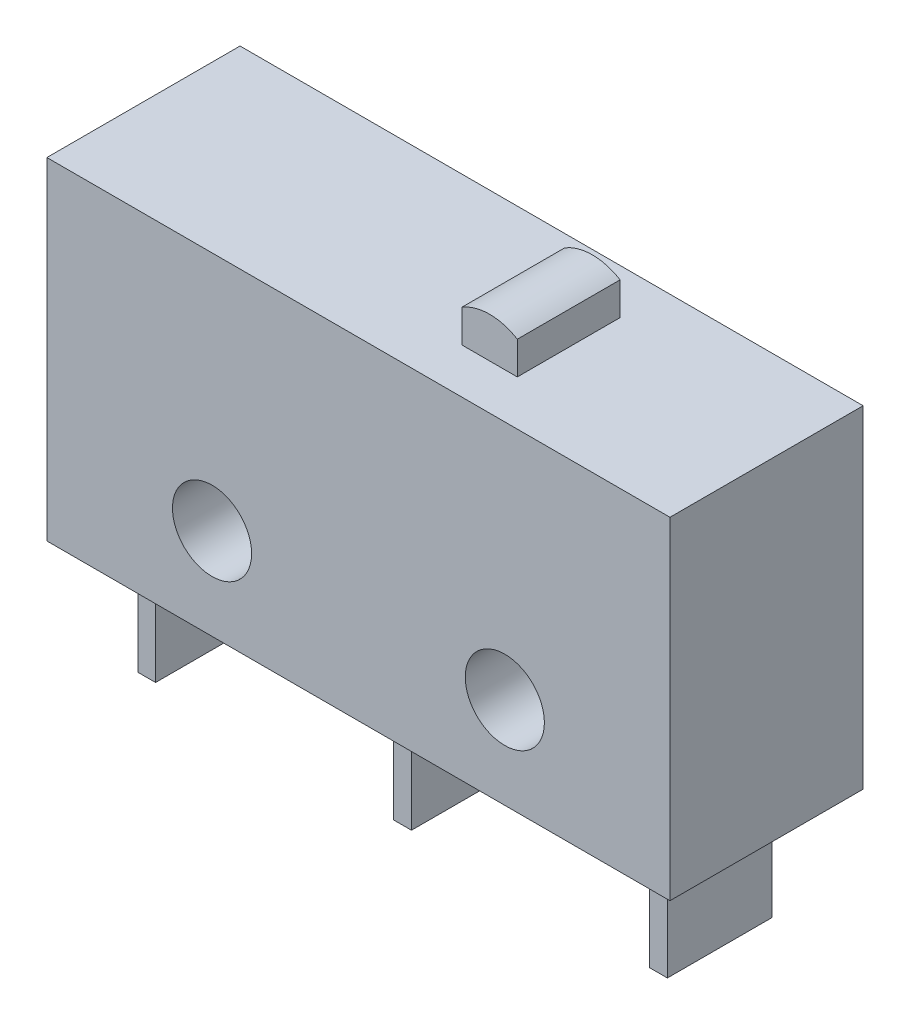
ISO-10303-21;
HEADER;
FILE_DESCRIPTION(('STEP AP214'),'2;1');
FILE_NAME('part.step','',(''),(''),'','','');
FILE_SCHEMA(('AUTOMOTIVE_DESIGN { 1 0 10303 214 1 1 1 1 }'));
ENDSEC;
DATA;
#1=APPLICATION_CONTEXT('core data for automotive mechanical design processes');
#2=APPLICATION_PROTOCOL_DEFINITION('international standard','automotive_design',2000,#1);
#3=PRODUCT_CONTEXT('',#1,'mechanical');
#4=PRODUCT('Part','Part','',(#3));
#5=PRODUCT_RELATED_PRODUCT_CATEGORY('part','',(#4));
#6=PRODUCT_DEFINITION_FORMATION('','',#4);
#7=PRODUCT_DEFINITION_CONTEXT('part definition',#1,'design');
#8=PRODUCT_DEFINITION('design','',#6,#7);
#9=PRODUCT_DEFINITION_SHAPE('','',#8);
#10=(LENGTH_UNIT() NAMED_UNIT(*) SI_UNIT(.MILLI.,.METRE.));
#11=(NAMED_UNIT(*) PLANE_ANGLE_UNIT() SI_UNIT($,.RADIAN.));
#12=(NAMED_UNIT(*) SI_UNIT($,.STERADIAN.) SOLID_ANGLE_UNIT());
#13=UNCERTAINTY_MEASURE_WITH_UNIT(LENGTH_MEASURE(1.E-05),#10,'distance_accuracy_value','');
#14=(GEOMETRIC_REPRESENTATION_CONTEXT(3) GLOBAL_UNCERTAINTY_ASSIGNED_CONTEXT((#13)) GLOBAL_UNIT_ASSIGNED_CONTEXT((#10,
#11,#12)) REPRESENTATION_CONTEXT('',''));
#15=CARTESIAN_POINT('',(0.,0.,0.));
#16=DIRECTION('',(0.,0.,1.));
#17=DIRECTION('',(1.,0.,0.));
#18=AXIS2_PLACEMENT_3D('',#15,#16,#17);
#19=CARTESIAN_POINT('',(3.65,11.96,-1.65));
#20=DIRECTION('',(0.,0.,1.));
#21=DIRECTION('',(1.,0.,0.));
#22=AXIS2_PLACEMENT_3D('',#19,#20,#21);
#23=PLANE('',#22);
#24=CARTESIAN_POINT('',(2.761,10.254358,-1.65));
#25=DIRECTION('',(0.,0.,1.));
#26=DIRECTION('',(1.,0.,0.));
#27=AXIS2_PLACEMENT_3D('',#24,#25,#26);
#28=CIRCLE('',#27,1.705642);
#29=CARTESIAN_POINT('',(1.872,11.71,-1.65));
#30=VERTEX_POINT('',#29);
#31=CARTESIAN_POINT('',(3.65,11.71,-1.65));
#32=VERTEX_POINT('',#31);
#33=EDGE_CURVE('E672',#30,#32,#28,.F.);
#34=ORIENTED_EDGE('',*,*,#33,.T.);
#35=DIRECTION('',(0.,-1.,0.));
#36=VECTOR('',#35,1.);
#37=CARTESIAN_POINT('',(3.65,11.96,-1.65));
#38=LINE('',#37,#36);
#39=CARTESIAN_POINT('',(3.65,10.66,-1.65));
#40=VERTEX_POINT('',#39);
#41=EDGE_CURVE('E66',#32,#40,#38,.T.);
#42=ORIENTED_EDGE('',*,*,#41,.T.);
#43=DIRECTION('',(-1.,0.,0.));
#44=VECTOR('',#43,1.);
#45=CARTESIAN_POINT('',(3.65,10.66,-1.65));
#46=LINE('',#45,#44);
#47=CARTESIAN_POINT('',(1.872,10.66,-1.65));
#48=VERTEX_POINT('',#47);
#49=EDGE_CURVE('E671',#40,#48,#46,.T.);
#50=ORIENTED_EDGE('',*,*,#49,.T.);
#51=DIRECTION('',(0.,-1.,0.));
#52=VECTOR('',#51,1.);
#53=CARTESIAN_POINT('',(1.872,11.96,-1.65));
#54=LINE('',#53,#52);
#55=EDGE_CURVE('E74',#30,#48,#54,.T.);
#56=ORIENTED_EDGE('',*,*,#55,.F.);
#57=EDGE_LOOP('',(#34,#42,#50,#56));
#58=FACE_BOUND('',#57,.T.);
#59=ADVANCED_FACE('F51',(#58),#23,.F.);
#60=CARTESIAN_POINT('',(3.65,11.96,1.65));
#61=DIRECTION('',(0.,0.,-1.));
#62=DIRECTION('',(-1.,0.,0.));
#63=AXIS2_PLACEMENT_3D('',#60,#61,#62);
#64=PLANE('',#63);
#65=DIRECTION('',(0.,-1.,0.));
#66=VECTOR('',#65,1.);
#67=CARTESIAN_POINT('',(3.65,11.96,1.65));
#68=LINE('',#67,#66);
#69=CARTESIAN_POINT('',(3.65,11.71,1.65));
#70=VERTEX_POINT('',#69);
#71=CARTESIAN_POINT('',(3.65,10.66,1.65));
#72=VERTEX_POINT('',#71);
#73=EDGE_CURVE('E203',#70,#72,#68,.T.);
#74=ORIENTED_EDGE('',*,*,#73,.F.);
#75=CARTESIAN_POINT('',(2.761,10.254358,1.65));
#76=DIRECTION('',(0.,0.,1.));
#77=DIRECTION('',(1.,0.,0.));
#78=AXIS2_PLACEMENT_3D('',#75,#76,#77);
#79=CIRCLE('',#78,1.705642);
#80=CARTESIAN_POINT('',(1.872,11.71,1.65));
#81=VERTEX_POINT('',#80);
#82=EDGE_CURVE('E191',#81,#70,#79,.F.);
#83=ORIENTED_EDGE('',*,*,#82,.F.);
#84=DIRECTION('',(0.,-1.,0.));
#85=VECTOR('',#84,1.);
#86=CARTESIAN_POINT('',(1.872,11.96,1.65));
#87=LINE('',#86,#85);
#88=CARTESIAN_POINT('',(1.872,10.66,1.65));
#89=VERTEX_POINT('',#88);
#90=EDGE_CURVE('E210',#81,#89,#87,.T.);
#91=ORIENTED_EDGE('',*,*,#90,.T.);
#92=DIRECTION('',(1.,0.,0.));
#93=VECTOR('',#92,1.);
#94=CARTESIAN_POINT('',(3.65,10.66,1.65));
#95=LINE('',#94,#93);
#96=EDGE_CURVE('E209',#89,#72,#95,.T.);
#97=ORIENTED_EDGE('',*,*,#96,.T.);
#98=EDGE_LOOP('',(#74,#83,#91,#97));
#99=FACE_BOUND('',#98,.T.);
#100=ADVANCED_FACE('F207',(#99),#64,.F.);
#101=CARTESIAN_POINT('',(10.,10.66,3.1));
#102=DIRECTION('',(0.,-1.,0.));
#103=DIRECTION('',(0.,0.,-1.));
#104=AXIS2_PLACEMENT_3D('',#101,#102,#103);
#105=PLANE('',#104);
#106=DIRECTION('',(-1.,0.,0.));
#107=VECTOR('',#106,1.);
#108=CARTESIAN_POINT('',(10.,10.66,-3.1));
#109=LINE('',#108,#107);
#110=CARTESIAN_POINT('',(10.,10.66,-3.1));
#111=VERTEX_POINT('',#110);
#112=CARTESIAN_POINT('',(-10.,10.66,-3.1));
#113=VERTEX_POINT('',#112);
#114=EDGE_CURVE('E335',#111,#113,#109,.T.);
#115=ORIENTED_EDGE('',*,*,#114,.T.);
#116=DIRECTION('',(0.,0.,-1.));
#117=VECTOR('',#116,1.);
#118=CARTESIAN_POINT('',(-10.,10.66,3.1));
#119=LINE('',#118,#117);
#120=CARTESIAN_POINT('',(-10.,10.66,3.1));
#121=VERTEX_POINT('',#120);
#122=EDGE_CURVE('E341',#121,#113,#119,.T.);
#123=ORIENTED_EDGE('',*,*,#122,.F.);
#124=DIRECTION('',(-1.,0.,0.));
#125=VECTOR('',#124,1.);
#126=CARTESIAN_POINT('',(10.,10.66,3.1));
#127=LINE('',#126,#125);
#128=CARTESIAN_POINT('',(10.,10.66,3.1));
#129=VERTEX_POINT('',#128);
#130=EDGE_CURVE('E339',#129,#121,#127,.T.);
#131=ORIENTED_EDGE('',*,*,#130,.F.);
#132=DIRECTION('',(0.,0.,-1.));
#133=VECTOR('',#132,1.);
#134=CARTESIAN_POINT('',(10.,10.66,3.1));
#135=LINE('',#134,#133);
#136=EDGE_CURVE('E351',#129,#111,#135,.T.);
#137=ORIENTED_EDGE('',*,*,#136,.T.);
#138=EDGE_LOOP('',(#115,#123,#131,#137));
#139=FACE_BOUND('',#138,.T.);
#140=DIRECTION('',(0.,0.,-1.));
#141=VECTOR('',#140,1.);
#142=CARTESIAN_POINT('',(3.65,10.66,1.65));
#143=LINE('',#142,#141);
#144=EDGE_CURVE('E670',#72,#40,#143,.T.);
#145=ORIENTED_EDGE('',*,*,#144,.F.);
#146=ORIENTED_EDGE('',*,*,#96,.F.);
#147=DIRECTION('',(0.,0.,1.));
#148=VECTOR('',#147,1.);
#149=CARTESIAN_POINT('',(1.872,10.66,1.65));
#150=LINE('',#149,#148);
#151=EDGE_CURVE('E213',#48,#89,#150,.T.);
#152=ORIENTED_EDGE('',*,*,#151,.F.);
#153=ORIENTED_EDGE('',*,*,#49,.F.);
#154=EDGE_LOOP('',(#145,#146,#152,#153));
#155=FACE_BOUND('',#154,.T.);
#156=ADVANCED_FACE('F367',(#139,#155),#105,.F.);
#157=CARTESIAN_POINT('',(10.,0.,3.1));
#158=DIRECTION('',(0.,1.,0.));
#159=DIRECTION('',(0.,0.,1.));
#160=AXIS2_PLACEMENT_3D('',#157,#158,#159);
#161=PLANE('',#160);
#162=DIRECTION('',(0.,0.,-1.));
#163=VECTOR('',#162,1.);
#164=CARTESIAN_POINT('',(-0.285750000000001,0.,1.68275));
#165=LINE('',#164,#163);
#166=CARTESIAN_POINT('',(-0.285750000000001,0.,1.68275));
#167=VERTEX_POINT('',#166);
#168=CARTESIAN_POINT('',(-0.285750000000001,0.,-1.68275));
#169=VERTEX_POINT('',#168);
#170=EDGE_CURVE('E252',#167,#169,#165,.T.);
#171=ORIENTED_EDGE('',*,*,#170,.F.);
#172=DIRECTION('',(-1.,0.,0.));
#173=VECTOR('',#172,1.);
#174=CARTESIAN_POINT('',(0.285749999999999,0.,1.68275));
#175=LINE('',#174,#173);
#176=CARTESIAN_POINT('',(0.28575,0.,1.68275));
#177=VERTEX_POINT('',#176);
#178=EDGE_CURVE('E257',#177,#167,#175,.T.);
#179=ORIENTED_EDGE('',*,*,#178,.F.);
#180=DIRECTION('',(0.,0.,1.));
#181=VECTOR('',#180,1.);
#182=CARTESIAN_POINT('',(0.285749999999999,0.,1.68275));
#183=LINE('',#182,#181);
#184=CARTESIAN_POINT('',(0.285750000000001,0.,-1.68275));
#185=VERTEX_POINT('',#184);
#186=EDGE_CURVE('E269',#185,#177,#183,.T.);
#187=ORIENTED_EDGE('',*,*,#186,.F.);
#188=DIRECTION('',(1.,0.,0.));
#189=VECTOR('',#188,1.);
#190=CARTESIAN_POINT('',(0.28575,0.,-1.68275));
#191=LINE('',#190,#189);
#192=EDGE_CURVE('E266',#169,#185,#191,.T.);
#193=ORIENTED_EDGE('',*,*,#192,.F.);
#194=EDGE_LOOP('',(#171,#179,#187,#193));
#195=FACE_BOUND('',#194,.T.);
#196=DIRECTION('',(1.,0.,0.));
#197=VECTOR('',#196,1.);
#198=CARTESIAN_POINT('',(10.,0.,-3.1));
#199=LINE('',#198,#197);
#200=CARTESIAN_POINT('',(-10.,0.,-3.1));
#201=VERTEX_POINT('',#200);
#202=CARTESIAN_POINT('',(10.,0.,-3.1));
#203=VERTEX_POINT('',#202);
#204=EDGE_CURVE('E344',#201,#203,#199,.T.);
#205=ORIENTED_EDGE('',*,*,#204,.T.);
#206=DIRECTION('',(0.,0.,-1.));
#207=VECTOR('',#206,1.);
#208=CARTESIAN_POINT('',(10.,0.,3.1));
#209=LINE('',#208,#207);
#210=CARTESIAN_POINT('',(10.,0.,3.1));
#211=VERTEX_POINT('',#210);
#212=EDGE_CURVE('E59',#211,#203,#209,.T.);
#213=ORIENTED_EDGE('',*,*,#212,.F.);
#214=DIRECTION('',(1.,0.,0.));
#215=VECTOR('',#214,1.);
#216=CARTESIAN_POINT('',(10.,0.,3.1));
#217=LINE('',#216,#215);
#218=CARTESIAN_POINT('',(-10.,0.,3.1));
#219=VERTEX_POINT('',#218);
#220=EDGE_CURVE('E334',#219,#211,#217,.T.);
#221=ORIENTED_EDGE('',*,*,#220,.F.);
#222=DIRECTION('',(0.,0.,-1.));
#223=VECTOR('',#222,1.);
#224=CARTESIAN_POINT('',(-10.,0.,3.1));
#225=LINE('',#224,#223);
#226=EDGE_CURVE('E12',#219,#201,#225,.T.);
#227=ORIENTED_EDGE('',*,*,#226,.T.);
#228=EDGE_LOOP('',(#205,#213,#221,#227));
#229=FACE_BOUND('',#228,.T.);
#230=DIRECTION('',(0.,0.,-1.));
#231=VECTOR('',#230,1.);
#232=CARTESIAN_POINT('',(-8.5,0.,1.68275));
#233=LINE('',#232,#231);
#234=CARTESIAN_POINT('',(-8.5,0.,1.68275));
#235=VERTEX_POINT('',#234);
#236=CARTESIAN_POINT('',(-8.5,0.,-1.68275));
#237=VERTEX_POINT('',#236);
#238=EDGE_CURVE('E285',#235,#237,#233,.T.);
#239=ORIENTED_EDGE('',*,*,#238,.F.);
#240=DIRECTION('',(-1.,0.,0.));
#241=VECTOR('',#240,1.);
#242=CARTESIAN_POINT('',(-7.9285,0.,1.68275));
#243=LINE('',#242,#241);
#244=CARTESIAN_POINT('',(-7.9285,0.,1.68275));
#245=VERTEX_POINT('',#244);
#246=EDGE_CURVE('E290',#245,#235,#243,.T.);
#247=ORIENTED_EDGE('',*,*,#246,.F.);
#248=DIRECTION('',(0.,0.,1.));
#249=VECTOR('',#248,1.);
#250=CARTESIAN_POINT('',(-7.9285,0.,1.68275));
#251=LINE('',#250,#249);
#252=CARTESIAN_POINT('',(-7.9285,0.,-1.68275));
#253=VERTEX_POINT('',#252);
#254=EDGE_CURVE('E302',#253,#245,#251,.T.);
#255=ORIENTED_EDGE('',*,*,#254,.F.);
#256=DIRECTION('',(1.,0.,0.));
#257=VECTOR('',#256,1.);
#258=CARTESIAN_POINT('',(-7.9285,0.,-1.68275));
#259=LINE('',#258,#257);
#260=EDGE_CURVE('E299',#237,#253,#259,.T.);
#261=ORIENTED_EDGE('',*,*,#260,.F.);
#262=EDGE_LOOP('',(#239,#247,#255,#261));
#263=FACE_BOUND('',#262,.T.);
#264=DIRECTION('',(0.,0.,-1.));
#265=VECTOR('',#264,1.);
#266=CARTESIAN_POINT('',(7.9285,0.,1.68275));
#267=LINE('',#266,#265);
#268=CARTESIAN_POINT('',(7.9285,0.,1.68275));
#269=VERTEX_POINT('',#268);
#270=CARTESIAN_POINT('',(7.9285,0.,-1.68275));
#271=VERTEX_POINT('',#270);
#272=EDGE_CURVE('E219',#269,#271,#267,.T.);
#273=ORIENTED_EDGE('',*,*,#272,.F.);
#274=DIRECTION('',(-1.,0.,0.));
#275=VECTOR('',#274,1.);
#276=CARTESIAN_POINT('',(8.5,0.,1.68275));
#277=LINE('',#276,#275);
#278=CARTESIAN_POINT('',(8.5,0.,1.68275));
#279=VERTEX_POINT('',#278);
#280=EDGE_CURVE('E224',#279,#269,#277,.T.);
#281=ORIENTED_EDGE('',*,*,#280,.F.);
#282=DIRECTION('',(0.,0.,1.));
#283=VECTOR('',#282,1.);
#284=CARTESIAN_POINT('',(8.5,0.,1.68275));
#285=LINE('',#284,#283);
#286=CARTESIAN_POINT('',(8.5,0.,-1.68275));
#287=VERTEX_POINT('',#286);
#288=EDGE_CURVE('E236',#287,#279,#285,.T.);
#289=ORIENTED_EDGE('',*,*,#288,.F.);
#290=DIRECTION('',(1.,0.,0.));
#291=VECTOR('',#290,1.);
#292=CARTESIAN_POINT('',(8.5,0.,-1.68275));
#293=LINE('',#292,#291);
#294=EDGE_CURVE('E233',#271,#287,#293,.T.);
#295=ORIENTED_EDGE('',*,*,#294,.F.);
#296=EDGE_LOOP('',(#273,#281,#289,#295));
#297=FACE_BOUND('',#296,.T.);
#298=ADVANCED_FACE('F375',(#195,#229,#263,#297),#161,.F.);
#299=CARTESIAN_POINT('',(-10.,10.66,3.1));
#300=DIRECTION('',(1.,0.,0.));
#301=DIRECTION('',(0.,0.,-1.));
#302=AXIS2_PLACEMENT_3D('',#299,#300,#301);
#303=PLANE('',#302);
#304=DIRECTION('',(0.,-1.,0.));
#305=VECTOR('',#304,1.);
#306=CARTESIAN_POINT('',(-10.,10.66,-3.1));
#307=LINE('',#306,#305);
#308=EDGE_CURVE('E322',#113,#201,#307,.T.);
#309=ORIENTED_EDGE('',*,*,#308,.T.);
#310=ORIENTED_EDGE('',*,*,#226,.F.);
#311=DIRECTION('',(0.,-1.,0.));
#312=VECTOR('',#311,1.);
#313=CARTESIAN_POINT('',(-10.,10.66,3.1));
#314=LINE('',#313,#312);
#315=EDGE_CURVE('E331',#121,#219,#314,.T.);
#316=ORIENTED_EDGE('',*,*,#315,.F.);
#317=ORIENTED_EDGE('',*,*,#122,.T.);
#318=EDGE_LOOP('',(#309,#310,#316,#317));
#319=FACE_BOUND('',#318,.T.);
#320=ADVANCED_FACE('F53',(#319),#303,.F.);
#321=CARTESIAN_POINT('',(10.,10.66,3.1));
#322=DIRECTION('',(-1.,0.,0.));
#323=DIRECTION('',(0.,0.,1.));
#324=AXIS2_PLACEMENT_3D('',#321,#322,#323);
#325=PLANE('',#324);
#326=DIRECTION('',(0.,1.,0.));
#327=VECTOR('',#326,1.);
#328=CARTESIAN_POINT('',(10.,10.66,-3.1));
#329=LINE('',#328,#327);
#330=EDGE_CURVE('E346',#203,#111,#329,.T.);
#331=ORIENTED_EDGE('',*,*,#330,.T.);
#332=ORIENTED_EDGE('',*,*,#136,.F.);
#333=DIRECTION('',(0.,1.,0.));
#334=VECTOR('',#333,1.);
#335=CARTESIAN_POINT('',(10.,10.66,3.1));
#336=LINE('',#335,#334);
#337=EDGE_CURVE('E337',#211,#129,#336,.T.);
#338=ORIENTED_EDGE('',*,*,#337,.F.);
#339=ORIENTED_EDGE('',*,*,#212,.T.);
#340=EDGE_LOOP('',(#331,#332,#338,#339));
#341=FACE_BOUND('',#340,.T.);
#342=ADVANCED_FACE('F358',(#341),#325,.F.);
#343=CARTESIAN_POINT('',(0.,0.,3.1));
#344=DIRECTION('',(0.,0.,-1.));
#345=DIRECTION('',(-1.,0.,0.));
#346=AXIS2_PLACEMENT_3D('',#343,#344,#345);
#347=PLANE('',#346);
#348=CARTESIAN_POINT('',(4.699,2.9337,3.1));
#349=DIRECTION('',(0.,0.,1.));
#350=DIRECTION('',(1.,0.,0.));
#351=AXIS2_PLACEMENT_3D('',#348,#349,#350);
#352=CIRCLE('',#351,1.27);
#353=CARTESIAN_POINT('',(5.969,2.9337,3.1));
#354=VERTEX_POINT('',#353);
#355=EDGE_CURVE('E323',#354,#354,#352,.T.);
#356=ORIENTED_EDGE('',*,*,#355,.F.);
#357=EDGE_LOOP('',(#356));
#358=FACE_BOUND('',#357,.T.);
#359=CARTESIAN_POINT('',(-4.699,2.9337,3.1));
#360=DIRECTION('',(0.,0.,1.));
#361=DIRECTION('',(1.,0.,0.));
#362=AXIS2_PLACEMENT_3D('',#359,#360,#361);
#363=CIRCLE('',#362,1.27);
#364=CARTESIAN_POINT('',(-3.429,2.9337,3.1));
#365=VERTEX_POINT('',#364);
#366=EDGE_CURVE('E318',#365,#365,#363,.T.);
#367=ORIENTED_EDGE('',*,*,#366,.F.);
#368=EDGE_LOOP('',(#367));
#369=FACE_BOUND('',#368,.T.);
#370=ORIENTED_EDGE('',*,*,#315,.T.);
#371=ORIENTED_EDGE('',*,*,#220,.T.);
#372=ORIENTED_EDGE('',*,*,#337,.T.);
#373=ORIENTED_EDGE('',*,*,#130,.T.);
#374=EDGE_LOOP('',(#370,#371,#372,#373));
#375=FACE_BOUND('',#374,.T.);
#376=ADVANCED_FACE('F374',(#358,#369,#375),#347,.F.);
#377=CARTESIAN_POINT('',(0.,0.,-3.1));
#378=DIRECTION('',(0.,0.,-1.));
#379=DIRECTION('',(-1.,0.,0.));
#380=AXIS2_PLACEMENT_3D('',#377,#378,#379);
#381=PLANE('',#380);
#382=CARTESIAN_POINT('',(4.699,2.9337,-3.1));
#383=DIRECTION('',(0.,0.,1.));
#384=DIRECTION('',(1.,0.,0.));
#385=AXIS2_PLACEMENT_3D('',#382,#383,#384);
#386=CIRCLE('',#385,1.27);
#387=CARTESIAN_POINT('',(5.969,2.9337,-3.1));
#388=VERTEX_POINT('',#387);
#389=EDGE_CURVE('E319',#388,#388,#386,.T.);
#390=ORIENTED_EDGE('',*,*,#389,.T.);
#391=EDGE_LOOP('',(#390));
#392=FACE_BOUND('',#391,.T.);
#393=CARTESIAN_POINT('',(-4.699,2.9337,-3.1));
#394=DIRECTION('',(0.,0.,1.));
#395=DIRECTION('',(1.,0.,0.));
#396=AXIS2_PLACEMENT_3D('',#393,#394,#395);
#397=CIRCLE('',#396,1.27);
#398=CARTESIAN_POINT('',(-3.429,2.9337,-3.1));
#399=VERTEX_POINT('',#398);
#400=EDGE_CURVE('E326',#399,#399,#397,.T.);
#401=ORIENTED_EDGE('',*,*,#400,.T.);
#402=EDGE_LOOP('',(#401));
#403=FACE_BOUND('',#402,.T.);
#404=ORIENTED_EDGE('',*,*,#308,.F.);
#405=ORIENTED_EDGE('',*,*,#114,.F.);
#406=ORIENTED_EDGE('',*,*,#330,.F.);
#407=ORIENTED_EDGE('',*,*,#204,.F.);
#408=EDGE_LOOP('',(#404,#405,#406,#407));
#409=FACE_BOUND('',#408,.T.);
#410=ADVANCED_FACE('F364',(#392,#403,#409),#381,.T.);
#411=CARTESIAN_POINT('',(-4.699,2.9337,-3.1));
#412=DIRECTION('',(0.,0.,1.));
#413=DIRECTION('',(1.,0.,0.));
#414=AXIS2_PLACEMENT_3D('',#411,#412,#413);
#415=CYLINDRICAL_SURFACE('',#414,1.27);
#416=ORIENTED_EDGE('',*,*,#400,.F.);
#417=EDGE_LOOP('',(#416));
#418=FACE_BOUND('',#417,.T.);
#419=ORIENTED_EDGE('',*,*,#366,.T.);
#420=EDGE_LOOP('',(#419));
#421=FACE_BOUND('',#420,.T.);
#422=ADVANCED_FACE('F588',(#418,#421),#415,.F.);
#423=CARTESIAN_POINT('',(4.699,2.9337,-3.1));
#424=DIRECTION('',(0.,0.,1.));
#425=DIRECTION('',(1.,0.,0.));
#426=AXIS2_PLACEMENT_3D('',#423,#424,#425);
#427=CYLINDRICAL_SURFACE('',#426,1.27);
#428=ORIENTED_EDGE('',*,*,#389,.F.);
#429=EDGE_LOOP('',(#428));
#430=FACE_BOUND('',#429,.T.);
#431=ORIENTED_EDGE('',*,*,#355,.T.);
#432=EDGE_LOOP('',(#431));
#433=FACE_BOUND('',#432,.T.);
#434=ADVANCED_FACE('F574',(#430,#433),#427,.F.);
#435=CARTESIAN_POINT('',(-8.5,-3.6068,1.68275));
#436=DIRECTION('',(1.,0.,0.));
#437=DIRECTION('',(0.,0.,-1.));
#438=AXIS2_PLACEMENT_3D('',#435,#436,#437);
#439=PLANE('',#438);
#440=ORIENTED_EDGE('',*,*,#238,.T.);
#441=DIRECTION('',(0.,1.,0.));
#442=VECTOR('',#441,1.);
#443=CARTESIAN_POINT('',(-8.5,-3.6068,-1.68275));
#444=LINE('',#443,#442);
#445=CARTESIAN_POINT('',(-8.5,-3.6068,-1.68275));
#446=VERTEX_POINT('',#445);
#447=EDGE_CURVE('E315',#446,#237,#444,.T.);
#448=ORIENTED_EDGE('',*,*,#447,.F.);
#449=DIRECTION('',(0.,0.,-1.));
#450=VECTOR('',#449,1.);
#451=CARTESIAN_POINT('',(-8.5,-3.6068,1.68275));
#452=LINE('',#451,#450);
#453=CARTESIAN_POINT('',(-8.5,-3.6068,1.68275));
#454=VERTEX_POINT('',#453);
#455=EDGE_CURVE('E286',#454,#446,#452,.T.);
#456=ORIENTED_EDGE('',*,*,#455,.F.);
#457=DIRECTION('',(0.,1.,0.));
#458=VECTOR('',#457,1.);
#459=CARTESIAN_POINT('',(-8.5,-3.6068,1.68275));
#460=LINE('',#459,#458);
#461=EDGE_CURVE('E296',#454,#235,#460,.T.);
#462=ORIENTED_EDGE('',*,*,#461,.T.);
#463=EDGE_LOOP('',(#440,#448,#456,#462));
#464=FACE_BOUND('',#463,.T.);
#465=ADVANCED_FACE('F565',(#464),#439,.F.);
#466=CARTESIAN_POINT('',(-7.9285,-3.6068,-1.68275));
#467=DIRECTION('',(0.,0.,1.));
#468=DIRECTION('',(1.,0.,0.));
#469=AXIS2_PLACEMENT_3D('',#466,#467,#468);
#470=PLANE('',#469);
#471=ORIENTED_EDGE('',*,*,#260,.T.);
#472=DIRECTION('',(0.,1.,0.));
#473=VECTOR('',#472,1.);
#474=CARTESIAN_POINT('',(-7.9285,-3.6068,-1.68275));
#475=LINE('',#474,#473);
#476=CARTESIAN_POINT('',(-7.9285,-3.6068,-1.68275));
#477=VERTEX_POINT('',#476);
#478=EDGE_CURVE('E312',#477,#253,#475,.T.);
#479=ORIENTED_EDGE('',*,*,#478,.F.);
#480=DIRECTION('',(1.,0.,0.));
#481=VECTOR('',#480,1.);
#482=CARTESIAN_POINT('',(-7.9285,-3.6068,-1.68275));
#483=LINE('',#482,#481);
#484=EDGE_CURVE('E289',#446,#477,#483,.T.);
#485=ORIENTED_EDGE('',*,*,#484,.F.);
#486=ORIENTED_EDGE('',*,*,#447,.T.);
#487=EDGE_LOOP('',(#471,#479,#485,#486));
#488=FACE_BOUND('',#487,.T.);
#489=ADVANCED_FACE('F556',(#488),#470,.F.);
#490=CARTESIAN_POINT('',(-7.9285,-3.6068,1.68275));
#491=DIRECTION('',(-1.,0.,0.));
#492=DIRECTION('',(0.,0.,1.));
#493=AXIS2_PLACEMENT_3D('',#490,#491,#492);
#494=PLANE('',#493);
#495=ORIENTED_EDGE('',*,*,#254,.T.);
#496=DIRECTION('',(0.,1.,0.));
#497=VECTOR('',#496,1.);
#498=CARTESIAN_POINT('',(-7.9285,-3.6068,1.68275));
#499=LINE('',#498,#497);
#500=CARTESIAN_POINT('',(-7.9285,-3.6068,1.68275));
#501=VERTEX_POINT('',#500);
#502=EDGE_CURVE('E309',#501,#245,#499,.T.);
#503=ORIENTED_EDGE('',*,*,#502,.F.);
#504=DIRECTION('',(0.,0.,1.));
#505=VECTOR('',#504,1.);
#506=CARTESIAN_POINT('',(-7.9285,-3.6068,1.68275));
#507=LINE('',#506,#505);
#508=EDGE_CURVE('E292',#477,#501,#507,.T.);
#509=ORIENTED_EDGE('',*,*,#508,.F.);
#510=ORIENTED_EDGE('',*,*,#478,.T.);
#511=EDGE_LOOP('',(#495,#503,#509,#510));
#512=FACE_BOUND('',#511,.T.);
#513=ADVANCED_FACE('F547',(#512),#494,.F.);
#514=CARTESIAN_POINT('',(-7.9285,-3.6068,1.68275));
#515=DIRECTION('',(0.,0.,-1.));
#516=DIRECTION('',(-1.,0.,0.));
#517=AXIS2_PLACEMENT_3D('',#514,#515,#516);
#518=PLANE('',#517);
#519=ORIENTED_EDGE('',*,*,#246,.T.);
#520=ORIENTED_EDGE('',*,*,#461,.F.);
#521=DIRECTION('',(-1.,0.,0.));
#522=VECTOR('',#521,1.);
#523=CARTESIAN_POINT('',(-7.9285,-3.6068,1.68275));
#524=LINE('',#523,#522);
#525=EDGE_CURVE('E294',#501,#454,#524,.T.);
#526=ORIENTED_EDGE('',*,*,#525,.F.);
#527=ORIENTED_EDGE('',*,*,#502,.T.);
#528=EDGE_LOOP('',(#519,#520,#526,#527));
#529=FACE_BOUND('',#528,.T.);
#530=ADVANCED_FACE('F538',(#529),#518,.F.);
#531=CARTESIAN_POINT('',(0.,-3.6068,0.));
#532=DIRECTION('',(0.,1.,0.));
#533=DIRECTION('',(0.,0.,1.));
#534=AXIS2_PLACEMENT_3D('',#531,#532,#533);
#535=PLANE('',#534);
#536=ORIENTED_EDGE('',*,*,#455,.T.);
#537=ORIENTED_EDGE('',*,*,#484,.T.);
#538=ORIENTED_EDGE('',*,*,#508,.T.);
#539=ORIENTED_EDGE('',*,*,#525,.T.);
#540=EDGE_LOOP('',(#536,#537,#538,#539));
#541=FACE_BOUND('',#540,.T.);
#542=ADVANCED_FACE('F529',(#541),#535,.F.);
#543=CARTESIAN_POINT('',(-0.285750000000001,-3.6068,1.68275));
#544=DIRECTION('',(1.,0.,0.));
#545=DIRECTION('',(0.,0.,-1.));
#546=AXIS2_PLACEMENT_3D('',#543,#544,#545);
#547=PLANE('',#546);
#548=ORIENTED_EDGE('',*,*,#170,.T.);
#549=DIRECTION('',(0.,1.,0.));
#550=VECTOR('',#549,1.);
#551=CARTESIAN_POINT('',(-0.28575,-3.6068,-1.68275));
#552=LINE('',#551,#550);
#553=CARTESIAN_POINT('',(-0.28575,-3.6068,-1.68275));
#554=VERTEX_POINT('',#553);
#555=EDGE_CURVE('E282',#554,#169,#552,.T.);
#556=ORIENTED_EDGE('',*,*,#555,.F.);
#557=DIRECTION('',(0.,0.,-1.));
#558=VECTOR('',#557,1.);
#559=CARTESIAN_POINT('',(-0.285750000000001,-3.6068,1.68275));
#560=LINE('',#559,#558);
#561=CARTESIAN_POINT('',(-0.285750000000001,-3.6068,1.68275));
#562=VERTEX_POINT('',#561);
#563=EDGE_CURVE('E253',#562,#554,#560,.T.);
#564=ORIENTED_EDGE('',*,*,#563,.F.);
#565=DIRECTION('',(0.,1.,0.));
#566=VECTOR('',#565,1.);
#567=CARTESIAN_POINT('',(-0.285750000000001,-3.6068,1.68275));
#568=LINE('',#567,#566);
#569=EDGE_CURVE('E263',#562,#167,#568,.T.);
#570=ORIENTED_EDGE('',*,*,#569,.T.);
#571=EDGE_LOOP('',(#548,#556,#564,#570));
#572=FACE_BOUND('',#571,.T.);
#573=ADVANCED_FACE('F520',(#572),#547,.F.);
#574=CARTESIAN_POINT('',(0.28575,-3.6068,-1.68275));
#575=DIRECTION('',(0.,0.,1.));
#576=DIRECTION('',(1.,0.,0.));
#577=AXIS2_PLACEMENT_3D('',#574,#575,#576);
#578=PLANE('',#577);
#579=ORIENTED_EDGE('',*,*,#192,.T.);
#580=DIRECTION('',(0.,1.,0.));
#581=VECTOR('',#580,1.);
#582=CARTESIAN_POINT('',(0.28575,-3.6068,-1.68275));
#583=LINE('',#582,#581);
#584=CARTESIAN_POINT('',(0.28575,-3.6068,-1.68275));
#585=VERTEX_POINT('',#584);
#586=EDGE_CURVE('E279',#585,#185,#583,.T.);
#587=ORIENTED_EDGE('',*,*,#586,.F.);
#588=DIRECTION('',(1.,0.,0.));
#589=VECTOR('',#588,1.);
#590=CARTESIAN_POINT('',(0.28575,-3.6068,-1.68275));
#591=LINE('',#590,#589);
#592=EDGE_CURVE('E256',#554,#585,#591,.T.);
#593=ORIENTED_EDGE('',*,*,#592,.F.);
#594=ORIENTED_EDGE('',*,*,#555,.T.);
#595=EDGE_LOOP('',(#579,#587,#593,#594));
#596=FACE_BOUND('',#595,.T.);
#597=ADVANCED_FACE('F511',(#596),#578,.F.);
#598=CARTESIAN_POINT('',(0.285749999999999,-3.6068,1.68275));
#599=DIRECTION('',(-1.,0.,0.));
#600=DIRECTION('',(0.,0.,1.));
#601=AXIS2_PLACEMENT_3D('',#598,#599,#600);
#602=PLANE('',#601);
#603=ORIENTED_EDGE('',*,*,#186,.T.);
#604=DIRECTION('',(0.,1.,0.));
#605=VECTOR('',#604,1.);
#606=CARTESIAN_POINT('',(0.285749999999999,-3.6068,1.68275));
#607=LINE('',#606,#605);
#608=CARTESIAN_POINT('',(0.285749999999999,-3.6068,1.68275));
#609=VERTEX_POINT('',#608);
#610=EDGE_CURVE('E276',#609,#177,#607,.T.);
#611=ORIENTED_EDGE('',*,*,#610,.F.);
#612=DIRECTION('',(0.,0.,1.));
#613=VECTOR('',#612,1.);
#614=CARTESIAN_POINT('',(0.285749999999999,-3.6068,1.68275));
#615=LINE('',#614,#613);
#616=EDGE_CURVE('E259',#585,#609,#615,.T.);
#617=ORIENTED_EDGE('',*,*,#616,.F.);
#618=ORIENTED_EDGE('',*,*,#586,.T.);
#619=EDGE_LOOP('',(#603,#611,#617,#618));
#620=FACE_BOUND('',#619,.T.);
#621=ADVANCED_FACE('F502',(#620),#602,.F.);
#622=CARTESIAN_POINT('',(0.285749999999999,-3.6068,1.68275));
#623=DIRECTION('',(0.,0.,-1.));
#624=DIRECTION('',(-1.,0.,0.));
#625=AXIS2_PLACEMENT_3D('',#622,#623,#624);
#626=PLANE('',#625);
#627=ORIENTED_EDGE('',*,*,#178,.T.);
#628=ORIENTED_EDGE('',*,*,#569,.F.);
#629=DIRECTION('',(-1.,0.,0.));
#630=VECTOR('',#629,1.);
#631=CARTESIAN_POINT('',(0.285749999999999,-3.6068,1.68275));
#632=LINE('',#631,#630);
#633=EDGE_CURVE('E261',#609,#562,#632,.T.);
#634=ORIENTED_EDGE('',*,*,#633,.F.);
#635=ORIENTED_EDGE('',*,*,#610,.T.);
#636=EDGE_LOOP('',(#627,#628,#634,#635));
#637=FACE_BOUND('',#636,.T.);
#638=ADVANCED_FACE('F493',(#637),#626,.F.);
#639=CARTESIAN_POINT('',(0.,-3.6068,0.));
#640=DIRECTION('',(0.,1.,0.));
#641=DIRECTION('',(0.,0.,1.));
#642=AXIS2_PLACEMENT_3D('',#639,#640,#641);
#643=PLANE('',#642);
#644=ORIENTED_EDGE('',*,*,#563,.T.);
#645=ORIENTED_EDGE('',*,*,#592,.T.);
#646=ORIENTED_EDGE('',*,*,#616,.T.);
#647=ORIENTED_EDGE('',*,*,#633,.T.);
#648=EDGE_LOOP('',(#644,#645,#646,#647));
#649=FACE_BOUND('',#648,.T.);
#650=ADVANCED_FACE('F404',(#649),#643,.F.);
#651=CARTESIAN_POINT('',(7.9285,-3.6068,1.68275));
#652=DIRECTION('',(1.,0.,0.));
#653=DIRECTION('',(0.,0.,-1.));
#654=AXIS2_PLACEMENT_3D('',#651,#652,#653);
#655=PLANE('',#654);
#656=ORIENTED_EDGE('',*,*,#272,.T.);
#657=DIRECTION('',(0.,1.,0.));
#658=VECTOR('',#657,1.);
#659=CARTESIAN_POINT('',(7.9285,-3.6068,-1.68275));
#660=LINE('',#659,#658);
#661=CARTESIAN_POINT('',(7.9285,-3.6068,-1.68275));
#662=VERTEX_POINT('',#661);
#663=EDGE_CURVE('E249',#662,#271,#660,.T.);
#664=ORIENTED_EDGE('',*,*,#663,.F.);
#665=DIRECTION('',(0.,0.,-1.));
#666=VECTOR('',#665,1.);
#667=CARTESIAN_POINT('',(7.9285,-3.6068,1.68275));
#668=LINE('',#667,#666);
#669=CARTESIAN_POINT('',(7.9285,-3.6068,1.68275));
#670=VERTEX_POINT('',#669);
#671=EDGE_CURVE('E220',#670,#662,#668,.T.);
#672=ORIENTED_EDGE('',*,*,#671,.F.);
#673=DIRECTION('',(0.,1.,0.));
#674=VECTOR('',#673,1.);
#675=CARTESIAN_POINT('',(7.9285,-3.6068,1.68275));
#676=LINE('',#675,#674);
#677=EDGE_CURVE('E230',#670,#269,#676,.T.);
#678=ORIENTED_EDGE('',*,*,#677,.T.);
#679=EDGE_LOOP('',(#656,#664,#672,#678));
#680=FACE_BOUND('',#679,.T.);
#681=ADVANCED_FACE('F388',(#680),#655,.F.);
#682=CARTESIAN_POINT('',(8.5,-3.6068,-1.68275));
#683=DIRECTION('',(0.,0.,1.));
#684=DIRECTION('',(1.,0.,0.));
#685=AXIS2_PLACEMENT_3D('',#682,#683,#684);
#686=PLANE('',#685);
#687=ORIENTED_EDGE('',*,*,#294,.T.);
#688=DIRECTION('',(0.,1.,0.));
#689=VECTOR('',#688,1.);
#690=CARTESIAN_POINT('',(8.5,-3.6068,-1.68275));
#691=LINE('',#690,#689);
#692=CARTESIAN_POINT('',(8.5,-3.6068,-1.68275));
#693=VERTEX_POINT('',#692);
#694=EDGE_CURVE('E246',#693,#287,#691,.T.);
#695=ORIENTED_EDGE('',*,*,#694,.F.);
#696=DIRECTION('',(1.,0.,0.));
#697=VECTOR('',#696,1.);
#698=CARTESIAN_POINT('',(8.5,-3.6068,-1.68275));
#699=LINE('',#698,#697);
#700=EDGE_CURVE('E223',#662,#693,#699,.T.);
#701=ORIENTED_EDGE('',*,*,#700,.F.);
#702=ORIENTED_EDGE('',*,*,#663,.T.);
#703=EDGE_LOOP('',(#687,#695,#701,#702));
#704=FACE_BOUND('',#703,.T.);
#705=ADVANCED_FACE('F396',(#704),#686,.F.);
#706=CARTESIAN_POINT('',(8.5,-3.6068,1.68275));
#707=DIRECTION('',(-1.,0.,0.));
#708=DIRECTION('',(0.,0.,1.));
#709=AXIS2_PLACEMENT_3D('',#706,#707,#708);
#710=PLANE('',#709);
#711=ORIENTED_EDGE('',*,*,#288,.T.);
#712=DIRECTION('',(0.,1.,0.));
#713=VECTOR('',#712,1.);
#714=CARTESIAN_POINT('',(8.5,-3.6068,1.68275));
#715=LINE('',#714,#713);
#716=CARTESIAN_POINT('',(8.5,-3.6068,1.68275));
#717=VERTEX_POINT('',#716);
#718=EDGE_CURVE('E243',#717,#279,#715,.T.);
#719=ORIENTED_EDGE('',*,*,#718,.F.);
#720=DIRECTION('',(0.,0.,1.));
#721=VECTOR('',#720,1.);
#722=CARTESIAN_POINT('',(8.5,-3.6068,1.68275));
#723=LINE('',#722,#721);
#724=EDGE_CURVE('E226',#693,#717,#723,.T.);
#725=ORIENTED_EDGE('',*,*,#724,.F.);
#726=ORIENTED_EDGE('',*,*,#694,.T.);
#727=EDGE_LOOP('',(#711,#719,#725,#726));
#728=FACE_BOUND('',#727,.T.);
#729=ADVANCED_FACE('F394',(#728),#710,.F.);
#730=CARTESIAN_POINT('',(8.5,-3.6068,1.68275));
#731=DIRECTION('',(0.,0.,-1.));
#732=DIRECTION('',(-1.,0.,0.));
#733=AXIS2_PLACEMENT_3D('',#730,#731,#732);
#734=PLANE('',#733);
#735=ORIENTED_EDGE('',*,*,#280,.T.);
#736=ORIENTED_EDGE('',*,*,#677,.F.);
#737=DIRECTION('',(-1.,0.,0.));
#738=VECTOR('',#737,1.);
#739=CARTESIAN_POINT('',(8.5,-3.6068,1.68275));
#740=LINE('',#739,#738);
#741=EDGE_CURVE('E228',#717,#670,#740,.T.);
#742=ORIENTED_EDGE('',*,*,#741,.F.);
#743=ORIENTED_EDGE('',*,*,#718,.T.);
#744=EDGE_LOOP('',(#735,#736,#742,#743));
#745=FACE_BOUND('',#744,.T.);
#746=ADVANCED_FACE('F384',(#745),#734,.F.);
#747=CARTESIAN_POINT('',(0.,-3.6068,0.));
#748=DIRECTION('',(0.,1.,0.));
#749=DIRECTION('',(0.,0.,1.));
#750=AXIS2_PLACEMENT_3D('',#747,#748,#749);
#751=PLANE('',#750);
#752=ORIENTED_EDGE('',*,*,#671,.T.);
#753=ORIENTED_EDGE('',*,*,#700,.T.);
#754=ORIENTED_EDGE('',*,*,#724,.T.);
#755=ORIENTED_EDGE('',*,*,#741,.T.);
#756=EDGE_LOOP('',(#752,#753,#754,#755));
#757=FACE_BOUND('',#756,.T.);
#758=ADVANCED_FACE('F390',(#757),#751,.F.);
#759=CARTESIAN_POINT('',(3.65,11.96,1.65));
#760=DIRECTION('',(-1.,0.,0.));
#761=DIRECTION('',(0.,0.,1.));
#762=AXIS2_PLACEMENT_3D('',#759,#760,#761);
#763=PLANE('',#762);
#764=ORIENTED_EDGE('',*,*,#41,.F.);
#765=DIRECTION('',(0.,0.,1.));
#766=VECTOR('',#765,1.);
#767=CARTESIAN_POINT('',(3.65,11.71,-3.1));
#768=LINE('',#767,#766);
#769=EDGE_CURVE('E194',#32,#70,#768,.T.);
#770=ORIENTED_EDGE('',*,*,#769,.T.);
#771=ORIENTED_EDGE('',*,*,#73,.T.);
#772=ORIENTED_EDGE('',*,*,#144,.T.);
#773=EDGE_LOOP('',(#764,#770,#771,#772));
#774=FACE_BOUND('',#773,.T.);
#775=ADVANCED_FACE('F201',(#774),#763,.F.);
#776=CARTESIAN_POINT('',(1.872,11.96,1.65));
#777=DIRECTION('',(1.,0.,0.));
#778=DIRECTION('',(0.,0.,-1.));
#779=AXIS2_PLACEMENT_3D('',#776,#777,#778);
#780=PLANE('',#779);
#781=ORIENTED_EDGE('',*,*,#90,.F.);
#782=DIRECTION('',(0.,0.,1.));
#783=VECTOR('',#782,1.);
#784=CARTESIAN_POINT('',(1.872,11.71,-3.1));
#785=LINE('',#784,#783);
#786=EDGE_CURVE('E195',#30,#81,#785,.T.);
#787=ORIENTED_EDGE('',*,*,#786,.F.);
#788=ORIENTED_EDGE('',*,*,#55,.T.);
#789=ORIENTED_EDGE('',*,*,#151,.T.);
#790=EDGE_LOOP('',(#781,#787,#788,#789));
#791=FACE_BOUND('',#790,.T.);
#792=ADVANCED_FACE('F414',(#791),#780,.F.);
#793=CARTESIAN_POINT('',(2.761,10.254358,-3.1));
#794=DIRECTION('',(0.,0.,1.));
#795=DIRECTION('',(1.,0.,0.));
#796=AXIS2_PLACEMENT_3D('',#793,#794,#795);
#797=CYLINDRICAL_SURFACE('',#796,1.705642);
#798=ORIENTED_EDGE('',*,*,#786,.T.);
#799=ORIENTED_EDGE('',*,*,#82,.T.);
#800=ORIENTED_EDGE('',*,*,#769,.F.);
#801=ORIENTED_EDGE('',*,*,#33,.F.);
#802=EDGE_LOOP('',(#798,#799,#800,#801));
#803=FACE_BOUND('',#802,.T.);
#804=ADVANCED_FACE('F193',(#803),#797,.T.);
#805=CLOSED_SHELL('',(#59,#100,#156,#298,#320,#342,#376,#410,#422,#434,#465,#489,#513,#530,#542,
#573,#597,#621,#638,#650,#681,#705,#729,#746,#758,#775,#792,#804));
#806=MANIFOLD_SOLID_BREP('B2',#805);
#807=ADVANCED_BREP_SHAPE_REPRESENTATION('',(#18,#806),#14);
#808=SHAPE_DEFINITION_REPRESENTATION(#9,#807);
ENDSEC;
END-ISO-10303-21;
